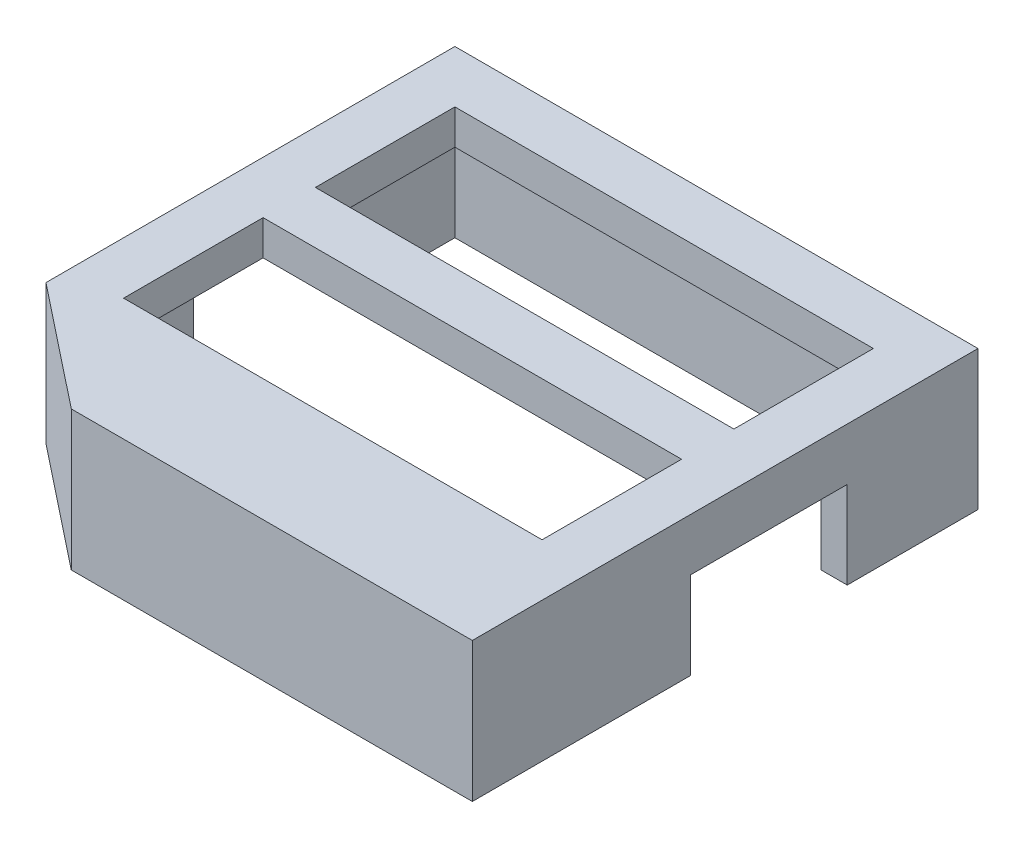
ISO-10303-21;
HEADER;
FILE_DESCRIPTION(('STEP AP214'),'2;1');
FILE_NAME('part.step','',(''),(''),'','','');
FILE_SCHEMA(('AUTOMOTIVE_DESIGN { 1 0 10303 214 1 1 1 1 }'));
ENDSEC;
DATA;
#1=APPLICATION_CONTEXT('core data for automotive mechanical design processes');
#2=APPLICATION_PROTOCOL_DEFINITION('international standard','automotive_design',2000,#1);
#3=PRODUCT_CONTEXT('',#1,'mechanical');
#4=PRODUCT('Part','Part','',(#3));
#5=PRODUCT_RELATED_PRODUCT_CATEGORY('part','',(#4));
#6=PRODUCT_DEFINITION_FORMATION('','',#4);
#7=PRODUCT_DEFINITION_CONTEXT('part definition',#1,'design');
#8=PRODUCT_DEFINITION('design','',#6,#7);
#9=PRODUCT_DEFINITION_SHAPE('','',#8);
#10=(LENGTH_UNIT() NAMED_UNIT(*) SI_UNIT(.MILLI.,.METRE.));
#11=(NAMED_UNIT(*) PLANE_ANGLE_UNIT() SI_UNIT($,.RADIAN.));
#12=(NAMED_UNIT(*) SI_UNIT($,.STERADIAN.) SOLID_ANGLE_UNIT());
#13=UNCERTAINTY_MEASURE_WITH_UNIT(LENGTH_MEASURE(1.E-05),#10,'distance_accuracy_value','');
#14=(GEOMETRIC_REPRESENTATION_CONTEXT(3) GLOBAL_UNCERTAINTY_ASSIGNED_CONTEXT((#13)) GLOBAL_UNIT_ASSIGNED_CONTEXT((#10,
#11,#12)) REPRESENTATION_CONTEXT('',''));
#15=CARTESIAN_POINT('',(0.,0.,0.));
#16=DIRECTION('',(0.,0.,1.));
#17=DIRECTION('',(1.,0.,0.));
#18=AXIS2_PLACEMENT_3D('',#15,#16,#17);
#19=CARTESIAN_POINT('',(0.,0.,0.));
#20=DIRECTION('',(0.,1.,0.));
#21=DIRECTION('',(0.,0.,1.));
#22=AXIS2_PLACEMENT_3D('',#19,#20,#21);
#23=PLANE('',#22);
#24=DIRECTION('',(0.,0.,-1.));
#25=VECTOR('',#24,1.);
#26=CARTESIAN_POINT('',(0.763392857142857,0.,-0.930803571428571));
#27=LINE('',#26,#25);
#28=CARTESIAN_POINT('',(0.763392857142872,0.,6.56919642857143));
#29=VERTEX_POINT('',#28);
#30=CARTESIAN_POINT('',(0.763392857142857,0.,-0.930803571428571));
#31=VERTEX_POINT('',#30);
#32=EDGE_CURVE('E232',#29,#31,#27,.T.);
#33=ORIENTED_EDGE('',*,*,#32,.F.);
#34=DIRECTION('',(-1.,0.,0.));
#35=VECTOR('',#34,1.);
#36=CARTESIAN_POINT('',(0.763392857142872,0.,6.56919642857143));
#37=LINE('',#36,#35);
#38=CARTESIAN_POINT('',(-0.736607142857139,0.,6.56919642857143));
#39=VERTEX_POINT('',#38);
#40=EDGE_CURVE('E213',#29,#39,#37,.T.);
#41=ORIENTED_EDGE('',*,*,#40,.T.);
#42=DIRECTION('',(0.,0.,1.));
#43=VECTOR('',#42,1.);
#44=CARTESIAN_POINT('',(-0.736607142857139,0.,0.569196428571429));
#45=LINE('',#44,#43);
#46=CARTESIAN_POINT('',(-0.736607142857139,0.,0.569196428571429));
#47=VERTEX_POINT('',#46);
#48=EDGE_CURVE('E336',#47,#39,#45,.T.);
#49=ORIENTED_EDGE('',*,*,#48,.F.);
#50=DIRECTION('',(1.,0.,0.));
#51=VECTOR('',#50,1.);
#52=CARTESIAN_POINT('',(-0.736607142857139,0.,0.569196428571429));
#53=LINE('',#52,#51);
#54=CARTESIAN_POINT('',(-27.7366071428571,0.,0.569196428571426));
#55=VERTEX_POINT('',#54);
#56=EDGE_CURVE('E319',#55,#47,#53,.T.);
#57=ORIENTED_EDGE('',*,*,#56,.F.);
#58=DIRECTION('',(0.,0.,-1.));
#59=VECTOR('',#58,1.);
#60=CARTESIAN_POINT('',(-27.7366071428571,0.,0.569196428571426));
#61=LINE('',#60,#59);
#62=CARTESIAN_POINT('',(-27.7366071428571,0.,6.56919642857143));
#63=VERTEX_POINT('',#62);
#64=EDGE_CURVE('E347',#63,#55,#61,.T.);
#65=ORIENTED_EDGE('',*,*,#64,.F.);
#66=CARTESIAN_POINT('',(-29.2366071428571,0.,6.56919642857143));
#67=VERTEX_POINT('',#66);
#68=EDGE_CURVE('E227',#63,#67,#37,.T.);
#69=ORIENTED_EDGE('',*,*,#68,.T.);
#70=DIRECTION('',(0.,0.,1.));
#71=VECTOR('',#70,1.);
#72=CARTESIAN_POINT('',(-29.2366071428571,0.,-0.930803571428571));
#73=LINE('',#72,#71);
#74=CARTESIAN_POINT('',(-29.2366071428571,0.,-0.930803571428571));
#75=VERTEX_POINT('',#74);
#76=EDGE_CURVE('E251',#75,#67,#73,.T.);
#77=ORIENTED_EDGE('',*,*,#76,.F.);
#78=DIRECTION('',(-1.,0.,0.));
#79=VECTOR('',#78,1.);
#80=CARTESIAN_POINT('',(-29.2366071428571,0.,-0.930803571428571));
#81=LINE('',#80,#79);
#82=EDGE_CURVE('E243',#31,#75,#81,.T.);
#83=ORIENTED_EDGE('',*,*,#82,.F.);
#84=EDGE_LOOP('',(#33,#41,#49,#57,#65,#69,#77,#83));
#85=FACE_BOUND('',#84,.T.);
#86=ADVANCED_FACE('F39',(#85),#23,.F.);
#87=CARTESIAN_POINT('',(-29.2366071428571,8.,-0.930803571428571));
#88=DIRECTION('',(1.,0.,0.));
#89=DIRECTION('',(0.,0.,-1.));
#90=AXIS2_PLACEMENT_3D('',#87,#88,#89);
#91=PLANE('',#90);
#92=ORIENTED_EDGE('',*,*,#76,.T.);
#93=DIRECTION('',(0.,-1.,0.));
#94=VECTOR('',#93,1.);
#95=CARTESIAN_POINT('',(-29.2366071428571,0.,6.56919642857143));
#96=LINE('',#95,#94);
#97=CARTESIAN_POINT('',(-29.2366071428571,5.,6.56919642857143));
#98=VERTEX_POINT('',#97);
#99=EDGE_CURVE('E516',#98,#67,#96,.T.);
#100=ORIENTED_EDGE('',*,*,#99,.F.);
#101=DIRECTION('',(0.,0.,-1.));
#102=VECTOR('',#101,1.);
#103=CARTESIAN_POINT('',(-29.2366071428571,5.,6.56919642857143));
#104=LINE('',#103,#102);
#105=CARTESIAN_POINT('',(-29.2366071428571,5.,15.5691964285714));
#106=VERTEX_POINT('',#105);
#107=EDGE_CURVE('E239',#106,#98,#104,.T.);
#108=ORIENTED_EDGE('',*,*,#107,.F.);
#109=DIRECTION('',(0.,1.,0.));
#110=VECTOR('',#109,1.);
#111=CARTESIAN_POINT('',(-29.2366071428571,0.,15.5691964285714));
#112=LINE('',#111,#110);
#113=CARTESIAN_POINT('',(-29.2366071428571,0.,15.5691964285714));
#114=VERTEX_POINT('',#113);
#115=EDGE_CURVE('E487',#114,#106,#112,.T.);
#116=ORIENTED_EDGE('',*,*,#115,.F.);
#117=CARTESIAN_POINT('',(-29.2366071428571,0.,22.5191407492151));
#118=VERTEX_POINT('',#117);
#119=EDGE_CURVE('E434',#114,#118,#73,.T.);
#120=ORIENTED_EDGE('',*,*,#119,.T.);
#121=DIRECTION('',(0.,1.,0.));
#122=VECTOR('',#121,1.);
#123=CARTESIAN_POINT('',(-29.2366071428571,0.,22.5191407492151));
#124=LINE('',#123,#122);
#125=CARTESIAN_POINT('',(-29.2366071428571,8.,22.5191407492151));
#126=VERTEX_POINT('',#125);
#127=EDGE_CURVE('E406',#118,#126,#124,.T.);
#128=ORIENTED_EDGE('',*,*,#127,.T.);
#129=DIRECTION('',(0.,0.,1.));
#130=VECTOR('',#129,1.);
#131=CARTESIAN_POINT('',(-29.2366071428571,8.,-0.930803571428571));
#132=LINE('',#131,#130);
#133=CARTESIAN_POINT('',(-29.2366071428571,8.,-0.930803571428571));
#134=VERTEX_POINT('',#133);
#135=EDGE_CURVE('E257',#134,#126,#132,.T.);
#136=ORIENTED_EDGE('',*,*,#135,.F.);
#137=DIRECTION('',(0.,-1.,0.));
#138=VECTOR('',#137,1.);
#139=CARTESIAN_POINT('',(-29.2366071428571,8.,-0.930803571428571));
#140=LINE('',#139,#138);
#141=EDGE_CURVE('E258',#134,#75,#140,.T.);
#142=ORIENTED_EDGE('',*,*,#141,.T.);
#143=EDGE_LOOP('',(#92,#100,#108,#116,#120,#128,#136,#142));
#144=FACE_BOUND('',#143,.T.);
#145=ADVANCED_FACE('F41',(#144),#91,.F.);
#146=CARTESIAN_POINT('',(-29.2366071428571,8.,28.0691964285714));
#147=DIRECTION('',(0.,0.,-1.));
#148=DIRECTION('',(-1.,0.,0.));
#149=AXIS2_PLACEMENT_3D('',#146,#147,#148);
#150=PLANE('',#149);
#151=DIRECTION('',(1.,0.,0.));
#152=VECTOR('',#151,1.);
#153=CARTESIAN_POINT('',(-29.2366071428571,8.,28.0691964285714));
#154=LINE('',#153,#152);
#155=CARTESIAN_POINT('',(-22.2366071428571,8.,28.0691964285714));
#156=VERTEX_POINT('',#155);
#157=CARTESIAN_POINT('',(0.763392857142861,8.,28.0691964285714));
#158=VERTEX_POINT('',#157);
#159=EDGE_CURVE('E472',#156,#158,#154,.T.);
#160=ORIENTED_EDGE('',*,*,#159,.F.);
#161=DIRECTION('',(0.,1.,0.));
#162=VECTOR('',#161,1.);
#163=CARTESIAN_POINT('',(-22.2366071428571,0.,28.0691964285714));
#164=LINE('',#163,#162);
#165=CARTESIAN_POINT('',(-22.2366071428571,0.,28.0691964285714));
#166=VERTEX_POINT('',#165);
#167=EDGE_CURVE('E403',#166,#156,#164,.T.);
#168=ORIENTED_EDGE('',*,*,#167,.F.);
#169=DIRECTION('',(1.,0.,0.));
#170=VECTOR('',#169,1.);
#171=CARTESIAN_POINT('',(-29.2366071428571,0.,28.0691964285714));
#172=LINE('',#171,#170);
#173=CARTESIAN_POINT('',(0.763392857142861,0.,28.0691964285714));
#174=VERTEX_POINT('',#173);
#175=EDGE_CURVE('E246',#166,#174,#172,.T.);
#176=ORIENTED_EDGE('',*,*,#175,.T.);
#177=DIRECTION('',(0.,-1.,0.));
#178=VECTOR('',#177,1.);
#179=CARTESIAN_POINT('',(0.763392857142861,8.,28.0691964285714));
#180=LINE('',#179,#178);
#181=EDGE_CURVE('E266',#158,#174,#180,.T.);
#182=ORIENTED_EDGE('',*,*,#181,.F.);
#183=EDGE_LOOP('',(#160,#168,#176,#182));
#184=FACE_BOUND('',#183,.T.);
#185=ADVANCED_FACE('F500',(#184),#150,.F.);
#186=CARTESIAN_POINT('',(0.763392857142857,8.,-0.930803571428571));
#187=DIRECTION('',(-1.,0.,0.));
#188=DIRECTION('',(0.,0.,1.));
#189=AXIS2_PLACEMENT_3D('',#186,#187,#188);
#190=PLANE('',#189);
#191=DIRECTION('',(0.,0.,-1.));
#192=VECTOR('',#191,1.);
#193=CARTESIAN_POINT('',(0.763392857142872,5.,6.56919642857143));
#194=LINE('',#193,#192);
#195=CARTESIAN_POINT('',(0.763392857142876,5.,15.5691964285714));
#196=VERTEX_POINT('',#195);
#197=CARTESIAN_POINT('',(0.763392857142872,5.,6.56919642857143));
#198=VERTEX_POINT('',#197);
#199=EDGE_CURVE('E236',#196,#198,#194,.T.);
#200=ORIENTED_EDGE('',*,*,#199,.T.);
#201=DIRECTION('',(0.,-1.,0.));
#202=VECTOR('',#201,1.);
#203=CARTESIAN_POINT('',(0.763392857142872,0.,6.56919642857143));
#204=LINE('',#203,#202);
#205=EDGE_CURVE('E217',#198,#29,#204,.T.);
#206=ORIENTED_EDGE('',*,*,#205,.T.);
#207=ORIENTED_EDGE('',*,*,#32,.T.);
#208=DIRECTION('',(0.,-1.,0.));
#209=VECTOR('',#208,1.);
#210=CARTESIAN_POINT('',(0.763392857142857,8.,-0.930803571428571));
#211=LINE('',#210,#209);
#212=CARTESIAN_POINT('',(0.763392857142857,8.,-0.930803571428571));
#213=VERTEX_POINT('',#212);
#214=EDGE_CURVE('E262',#213,#31,#211,.T.);
#215=ORIENTED_EDGE('',*,*,#214,.F.);
#216=DIRECTION('',(0.,0.,-1.));
#217=VECTOR('',#216,1.);
#218=CARTESIAN_POINT('',(0.763392857142857,8.,-0.930803571428571));
#219=LINE('',#218,#217);
#220=EDGE_CURVE('E475',#158,#213,#219,.T.);
#221=ORIENTED_EDGE('',*,*,#220,.F.);
#222=ORIENTED_EDGE('',*,*,#181,.T.);
#223=CARTESIAN_POINT('',(0.763392857142876,0.,15.5691964285714));
#224=VERTEX_POINT('',#223);
#225=EDGE_CURVE('E245',#174,#224,#27,.T.);
#226=ORIENTED_EDGE('',*,*,#225,.T.);
#227=DIRECTION('',(0.,1.,0.));
#228=VECTOR('',#227,1.);
#229=CARTESIAN_POINT('',(0.763392857142876,0.,15.5691964285714));
#230=LINE('',#229,#228);
#231=EDGE_CURVE('E238',#224,#196,#230,.T.);
#232=ORIENTED_EDGE('',*,*,#231,.T.);
#233=EDGE_LOOP('',(#200,#206,#207,#215,#221,#222,#226,#232));
#234=FACE_BOUND('',#233,.T.);
#235=ADVANCED_FACE('F230',(#234),#190,.F.);
#236=CARTESIAN_POINT('',(-29.2366071428571,8.,-0.930803571428571));
#237=DIRECTION('',(0.,0.,1.));
#238=DIRECTION('',(1.,0.,0.));
#239=AXIS2_PLACEMENT_3D('',#236,#237,#238);
#240=PLANE('',#239);
#241=ORIENTED_EDGE('',*,*,#82,.T.);
#242=ORIENTED_EDGE('',*,*,#141,.F.);
#243=DIRECTION('',(-1.,0.,0.));
#244=VECTOR('',#243,1.);
#245=CARTESIAN_POINT('',(-29.2366071428571,8.,-0.930803571428571));
#246=LINE('',#245,#244);
#247=EDGE_CURVE('E263',#213,#134,#246,.T.);
#248=ORIENTED_EDGE('',*,*,#247,.F.);
#249=ORIENTED_EDGE('',*,*,#214,.T.);
#250=EDGE_LOOP('',(#241,#242,#248,#249));
#251=FACE_BOUND('',#250,.T.);
#252=ADVANCED_FACE('F548',(#251),#240,.F.);
#253=CARTESIAN_POINT('',(0.,8.,0.));
#254=DIRECTION('',(0.,1.,0.));
#255=DIRECTION('',(0.,0.,1.));
#256=AXIS2_PLACEMENT_3D('',#253,#254,#255);
#257=PLANE('',#256);
#258=DIRECTION('',(-0.783588601449101,0.,-0.621280052535925));
#259=VECTOR('',#258,1.);
#260=CARTESIAN_POINT('',(-29.2366071428571,8.,22.5191407492151));
#261=LINE('',#260,#259);
#262=EDGE_CURVE('E398',#156,#126,#261,.T.);
#263=ORIENTED_EDGE('',*,*,#262,.F.);
#264=ORIENTED_EDGE('',*,*,#159,.T.);
#265=ORIENTED_EDGE('',*,*,#220,.T.);
#266=ORIENTED_EDGE('',*,*,#247,.T.);
#267=ORIENTED_EDGE('',*,*,#135,.T.);
#268=EDGE_LOOP('',(#263,#264,#265,#266,#267));
#269=FACE_BOUND('',#268,.T.);
#270=DIRECTION('',(0.,0.,1.));
#271=VECTOR('',#270,1.);
#272=CARTESIAN_POINT('',(-26.2366071428571,8.,2.06919642857143));
#273=LINE('',#272,#271);
#274=CARTESIAN_POINT('',(-26.2366071428571,8.,2.06919642857143));
#275=VERTEX_POINT('',#274);
#276=CARTESIAN_POINT('',(-26.2366071428571,8.,10.0691964285714));
#277=VERTEX_POINT('',#276);
#278=EDGE_CURVE('E413',#275,#277,#273,.T.);
#279=ORIENTED_EDGE('',*,*,#278,.F.);
#280=DIRECTION('',(-1.,0.,0.));
#281=VECTOR('',#280,1.);
#282=CARTESIAN_POINT('',(-26.2366071428571,8.,2.06919642857143));
#283=LINE('',#282,#281);
#284=CARTESIAN_POINT('',(-2.23660714285714,8.,2.06919642857143));
#285=VERTEX_POINT('',#284);
#286=EDGE_CURVE('E426',#285,#275,#283,.T.);
#287=ORIENTED_EDGE('',*,*,#286,.F.);
#288=DIRECTION('',(0.,0.,-1.));
#289=VECTOR('',#288,1.);
#290=CARTESIAN_POINT('',(-2.23660714285714,8.,2.06919642857143));
#291=LINE('',#290,#289);
#292=CARTESIAN_POINT('',(-2.23660714285714,8.,10.0691964285714));
#293=VERTEX_POINT('',#292);
#294=EDGE_CURVE('E422',#293,#285,#291,.T.);
#295=ORIENTED_EDGE('',*,*,#294,.F.);
#296=DIRECTION('',(1.,0.,0.));
#297=VECTOR('',#296,1.);
#298=CARTESIAN_POINT('',(-26.2366071428571,8.,10.0691964285714));
#299=LINE('',#298,#297);
#300=EDGE_CURVE('E417',#277,#293,#299,.T.);
#301=ORIENTED_EDGE('',*,*,#300,.F.);
#302=EDGE_LOOP('',(#279,#287,#295,#301));
#303=FACE_BOUND('',#302,.T.);
#304=DIRECTION('',(0.,0.,1.));
#305=VECTOR('',#304,1.);
#306=CARTESIAN_POINT('',(-26.2366071428571,8.,13.0691964285714));
#307=LINE('',#306,#305);
#308=CARTESIAN_POINT('',(-26.2366071428571,8.,13.0691964285714));
#309=VERTEX_POINT('',#308);
#310=CARTESIAN_POINT('',(-26.2366071428571,8.,21.0691964285714));
#311=VERTEX_POINT('',#310);
#312=EDGE_CURVE('E410',#309,#311,#307,.T.);
#313=ORIENTED_EDGE('',*,*,#312,.F.);
#314=DIRECTION('',(-1.,0.,0.));
#315=VECTOR('',#314,1.);
#316=CARTESIAN_POINT('',(-26.2366071428571,8.,13.0691964285714));
#317=LINE('',#316,#315);
#318=CARTESIAN_POINT('',(-2.23660714285714,8.,13.0691964285714));
#319=VERTEX_POINT('',#318);
#320=EDGE_CURVE('E454',#319,#309,#317,.T.);
#321=ORIENTED_EDGE('',*,*,#320,.F.);
#322=DIRECTION('',(0.,0.,-1.));
#323=VECTOR('',#322,1.);
#324=CARTESIAN_POINT('',(-2.23660714285714,8.,13.0691964285714));
#325=LINE('',#324,#323);
#326=CARTESIAN_POINT('',(-2.23660714285714,8.,21.0691964285714));
#327=VERTEX_POINT('',#326);
#328=EDGE_CURVE('E450',#327,#319,#325,.T.);
#329=ORIENTED_EDGE('',*,*,#328,.F.);
#330=DIRECTION('',(1.,0.,0.));
#331=VECTOR('',#330,1.);
#332=CARTESIAN_POINT('',(-26.2366071428571,8.,21.0691964285714));
#333=LINE('',#332,#331);
#334=EDGE_CURVE('E446',#311,#327,#333,.T.);
#335=ORIENTED_EDGE('',*,*,#334,.F.);
#336=EDGE_LOOP('',(#313,#321,#329,#335));
#337=FACE_BOUND('',#336,.T.);
#338=ADVANCED_FACE('F504',(#269,#303,#337),#257,.T.);
#339=ORIENTED_EDGE('',*,*,#119,.F.);
#340=DIRECTION('',(-1.,0.,0.));
#341=VECTOR('',#340,1.);
#342=CARTESIAN_POINT('',(0.763392857142876,0.,15.5691964285714));
#343=LINE('',#342,#341);
#344=CARTESIAN_POINT('',(-27.7366071428571,0.,15.5691964285714));
#345=VERTEX_POINT('',#344);
#346=EDGE_CURVE('E226',#345,#114,#343,.T.);
#347=ORIENTED_EDGE('',*,*,#346,.F.);
#348=CARTESIAN_POINT('',(-27.7366071428571,0.,21.7941685888933));
#349=VERTEX_POINT('',#348);
#350=EDGE_CURVE('E348',#349,#345,#61,.T.);
#351=ORIENTED_EDGE('',*,*,#350,.F.);
#352=DIRECTION('',(-0.783588601449101,0.,-0.621280052535925));
#353=VECTOR('',#352,1.);
#354=CARTESIAN_POINT('',(-27.7366071428571,0.,21.7941685888933));
#355=LINE('',#354,#353);
#356=CARTESIAN_POINT('',(-21.714109926825,0.,26.5691964285714));
#357=VERTEX_POINT('',#356);
#358=EDGE_CURVE('E343',#357,#349,#355,.T.);
#359=ORIENTED_EDGE('',*,*,#358,.F.);
#360=DIRECTION('',(-1.,0.,0.));
#361=VECTOR('',#360,1.);
#362=CARTESIAN_POINT('',(-21.714109926825,0.,26.5691964285714));
#363=LINE('',#362,#361);
#364=CARTESIAN_POINT('',(-0.73660714285714,0.,26.5691964285714));
#365=VERTEX_POINT('',#364);
#366=EDGE_CURVE('E339',#365,#357,#363,.T.);
#367=ORIENTED_EDGE('',*,*,#366,.F.);
#368=CARTESIAN_POINT('',(-0.736607142857139,0.,15.5691964285714));
#369=VERTEX_POINT('',#368);
#370=EDGE_CURVE('E313',#369,#365,#45,.T.);
#371=ORIENTED_EDGE('',*,*,#370,.F.);
#372=EDGE_CURVE('E55',#224,#369,#343,.T.);
#373=ORIENTED_EDGE('',*,*,#372,.F.);
#374=ORIENTED_EDGE('',*,*,#225,.F.);
#375=ORIENTED_EDGE('',*,*,#175,.F.);
#376=DIRECTION('',(-0.783588601449101,0.,-0.621280052535925));
#377=VECTOR('',#376,1.);
#378=CARTESIAN_POINT('',(-29.2366071428571,0.,22.5191407492151));
#379=LINE('',#378,#377);
#380=EDGE_CURVE('E399',#166,#118,#379,.T.);
#381=ORIENTED_EDGE('',*,*,#380,.T.);
#382=EDGE_LOOP('',(#339,#347,#351,#359,#367,#371,#373,#374,#375,#381));
#383=FACE_BOUND('',#382,.T.);
#384=ADVANCED_FACE('F495',(#383),#23,.F.);
#385=CARTESIAN_POINT('',(-26.2366071428571,0.,13.0691964285714));
#386=DIRECTION('',(-1.,0.,0.));
#387=DIRECTION('',(0.,0.,1.));
#388=AXIS2_PLACEMENT_3D('',#385,#386,#387);
#389=PLANE('',#388);
#390=DIRECTION('',(0.,1.,0.));
#391=VECTOR('',#390,1.);
#392=CARTESIAN_POINT('',(-26.2366071428571,0.,21.0691964285714));
#393=LINE('',#392,#391);
#394=CARTESIAN_POINT('',(-26.2366071428571,6.,21.0691964285714));
#395=VERTEX_POINT('',#394);
#396=EDGE_CURVE('E458',#395,#311,#393,.T.);
#397=ORIENTED_EDGE('',*,*,#396,.F.);
#398=DIRECTION('',(0.,0.,-1.));
#399=VECTOR('',#398,1.);
#400=CARTESIAN_POINT('',(-26.2366071428571,6.,13.0691964285714));
#401=LINE('',#400,#399);
#402=CARTESIAN_POINT('',(-26.2366071428571,6.,13.0691964285714));
#403=VERTEX_POINT('',#402);
#404=EDGE_CURVE('E394',#395,#403,#401,.T.);
#405=ORIENTED_EDGE('',*,*,#404,.T.);
#406=DIRECTION('',(0.,1.,0.));
#407=VECTOR('',#406,1.);
#408=CARTESIAN_POINT('',(-26.2366071428571,0.,13.0691964285714));
#409=LINE('',#408,#407);
#410=EDGE_CURVE('E418',#403,#309,#409,.T.);
#411=ORIENTED_EDGE('',*,*,#410,.T.);
#412=ORIENTED_EDGE('',*,*,#312,.T.);
#413=EDGE_LOOP('',(#397,#405,#411,#412));
#414=FACE_BOUND('',#413,.T.);
#415=ADVANCED_FACE('F540',(#414),#389,.F.);
#416=CARTESIAN_POINT('',(-26.2366071428571,0.,13.0691964285714));
#417=DIRECTION('',(0.,0.,-1.));
#418=DIRECTION('',(-1.,0.,0.));
#419=AXIS2_PLACEMENT_3D('',#416,#417,#418);
#420=PLANE('',#419);
#421=ORIENTED_EDGE('',*,*,#410,.F.);
#422=DIRECTION('',(1.,0.,0.));
#423=VECTOR('',#422,1.);
#424=CARTESIAN_POINT('',(-26.2366071428571,6.,13.0691964285714));
#425=LINE('',#424,#423);
#426=CARTESIAN_POINT('',(-2.23660714285714,6.,13.0691964285714));
#427=VERTEX_POINT('',#426);
#428=EDGE_CURVE('E390',#403,#427,#425,.T.);
#429=ORIENTED_EDGE('',*,*,#428,.T.);
#430=DIRECTION('',(0.,1.,0.));
#431=VECTOR('',#430,1.);
#432=CARTESIAN_POINT('',(-2.23660714285714,0.,13.0691964285714));
#433=LINE('',#432,#431);
#434=EDGE_CURVE('E461',#427,#319,#433,.T.);
#435=ORIENTED_EDGE('',*,*,#434,.T.);
#436=ORIENTED_EDGE('',*,*,#320,.T.);
#437=EDGE_LOOP('',(#421,#429,#435,#436));
#438=FACE_BOUND('',#437,.T.);
#439=ADVANCED_FACE('F545',(#438),#420,.F.);
#440=CARTESIAN_POINT('',(-2.23660714285714,0.,13.0691964285714));
#441=DIRECTION('',(1.,0.,0.));
#442=DIRECTION('',(0.,0.,-1.));
#443=AXIS2_PLACEMENT_3D('',#440,#441,#442);
#444=PLANE('',#443);
#445=ORIENTED_EDGE('',*,*,#434,.F.);
#446=DIRECTION('',(0.,0.,1.));
#447=VECTOR('',#446,1.);
#448=CARTESIAN_POINT('',(-2.23660714285714,6.,13.0691964285714));
#449=LINE('',#448,#447);
#450=CARTESIAN_POINT('',(-2.23660714285714,6.,21.0691964285714));
#451=VERTEX_POINT('',#450);
#452=EDGE_CURVE('E386',#427,#451,#449,.T.);
#453=ORIENTED_EDGE('',*,*,#452,.T.);
#454=DIRECTION('',(0.,1.,0.));
#455=VECTOR('',#454,1.);
#456=CARTESIAN_POINT('',(-2.23660714285714,0.,21.0691964285714));
#457=LINE('',#456,#455);
#458=EDGE_CURVE('E464',#451,#327,#457,.T.);
#459=ORIENTED_EDGE('',*,*,#458,.T.);
#460=ORIENTED_EDGE('',*,*,#328,.T.);
#461=EDGE_LOOP('',(#445,#453,#459,#460));
#462=FACE_BOUND('',#461,.T.);
#463=ADVANCED_FACE('F557',(#462),#444,.F.);
#464=CARTESIAN_POINT('',(-26.2366071428571,0.,21.0691964285714));
#465=DIRECTION('',(0.,0.,1.));
#466=DIRECTION('',(1.,0.,0.));
#467=AXIS2_PLACEMENT_3D('',#464,#465,#466);
#468=PLANE('',#467);
#469=ORIENTED_EDGE('',*,*,#458,.F.);
#470=DIRECTION('',(-1.,0.,0.));
#471=VECTOR('',#470,1.);
#472=CARTESIAN_POINT('',(-26.2366071428571,6.,21.0691964285714));
#473=LINE('',#472,#471);
#474=EDGE_CURVE('E382',#451,#395,#473,.T.);
#475=ORIENTED_EDGE('',*,*,#474,.T.);
#476=ORIENTED_EDGE('',*,*,#396,.T.);
#477=ORIENTED_EDGE('',*,*,#334,.T.);
#478=EDGE_LOOP('',(#469,#475,#476,#477));
#479=FACE_BOUND('',#478,.T.);
#480=ADVANCED_FACE('F553',(#479),#468,.F.);
#481=CARTESIAN_POINT('',(-26.2366071428571,0.,2.06919642857143));
#482=DIRECTION('',(-1.,0.,0.));
#483=DIRECTION('',(0.,0.,1.));
#484=AXIS2_PLACEMENT_3D('',#481,#482,#483);
#485=PLANE('',#484);
#486=DIRECTION('',(0.,1.,0.));
#487=VECTOR('',#486,1.);
#488=CARTESIAN_POINT('',(-26.2366071428571,0.,10.0691964285714));
#489=LINE('',#488,#487);
#490=CARTESIAN_POINT('',(-26.2366071428571,6.,10.0691964285714));
#491=VERTEX_POINT('',#490);
#492=EDGE_CURVE('E430',#491,#277,#489,.T.);
#493=ORIENTED_EDGE('',*,*,#492,.F.);
#494=DIRECTION('',(0.,0.,-1.));
#495=VECTOR('',#494,1.);
#496=CARTESIAN_POINT('',(-26.2366071428571,6.,2.06919642857143));
#497=LINE('',#496,#495);
#498=CARTESIAN_POINT('',(-26.2366071428571,6.,2.06919642857143));
#499=VERTEX_POINT('',#498);
#500=EDGE_CURVE('E378',#491,#499,#497,.T.);
#501=ORIENTED_EDGE('',*,*,#500,.T.);
#502=DIRECTION('',(0.,1.,0.));
#503=VECTOR('',#502,1.);
#504=CARTESIAN_POINT('',(-26.2366071428571,0.,2.06919642857143));
#505=LINE('',#504,#503);
#506=EDGE_CURVE('E431',#499,#275,#505,.T.);
#507=ORIENTED_EDGE('',*,*,#506,.T.);
#508=ORIENTED_EDGE('',*,*,#278,.T.);
#509=EDGE_LOOP('',(#493,#501,#507,#508));
#510=FACE_BOUND('',#509,.T.);
#511=ADVANCED_FACE('F556',(#510),#485,.F.);
#512=CARTESIAN_POINT('',(-26.2366071428571,0.,2.06919642857143));
#513=DIRECTION('',(0.,0.,-1.));
#514=DIRECTION('',(-1.,0.,0.));
#515=AXIS2_PLACEMENT_3D('',#512,#513,#514);
#516=PLANE('',#515);
#517=ORIENTED_EDGE('',*,*,#506,.F.);
#518=DIRECTION('',(1.,0.,0.));
#519=VECTOR('',#518,1.);
#520=CARTESIAN_POINT('',(-26.2366071428571,6.,2.06919642857143));
#521=LINE('',#520,#519);
#522=CARTESIAN_POINT('',(-2.23660714285714,6.,2.06919642857143));
#523=VERTEX_POINT('',#522);
#524=EDGE_CURVE('E374',#499,#523,#521,.T.);
#525=ORIENTED_EDGE('',*,*,#524,.T.);
#526=DIRECTION('',(0.,1.,0.));
#527=VECTOR('',#526,1.);
#528=CARTESIAN_POINT('',(-2.23660714285714,0.,2.06919642857143));
#529=LINE('',#528,#527);
#530=EDGE_CURVE('E435',#523,#285,#529,.T.);
#531=ORIENTED_EDGE('',*,*,#530,.T.);
#532=ORIENTED_EDGE('',*,*,#286,.T.);
#533=EDGE_LOOP('',(#517,#525,#531,#532));
#534=FACE_BOUND('',#533,.T.);
#535=ADVANCED_FACE('F567',(#534),#516,.F.);
#536=CARTESIAN_POINT('',(-2.23660714285714,0.,2.06919642857143));
#537=DIRECTION('',(1.,0.,0.));
#538=DIRECTION('',(0.,0.,-1.));
#539=AXIS2_PLACEMENT_3D('',#536,#537,#538);
#540=PLANE('',#539);
#541=ORIENTED_EDGE('',*,*,#530,.F.);
#542=DIRECTION('',(0.,0.,1.));
#543=VECTOR('',#542,1.);
#544=CARTESIAN_POINT('',(-2.23660714285714,6.,2.06919642857143));
#545=LINE('',#544,#543);
#546=CARTESIAN_POINT('',(-2.23660714285714,6.,10.0691964285714));
#547=VERTEX_POINT('',#546);
#548=EDGE_CURVE('E357',#523,#547,#545,.T.);
#549=ORIENTED_EDGE('',*,*,#548,.T.);
#550=DIRECTION('',(0.,1.,0.));
#551=VECTOR('',#550,1.);
#552=CARTESIAN_POINT('',(-2.23660714285714,0.,10.0691964285714));
#553=LINE('',#552,#551);
#554=EDGE_CURVE('E438',#547,#293,#553,.T.);
#555=ORIENTED_EDGE('',*,*,#554,.T.);
#556=ORIENTED_EDGE('',*,*,#294,.T.);
#557=EDGE_LOOP('',(#541,#549,#555,#556));
#558=FACE_BOUND('',#557,.T.);
#559=ADVANCED_FACE('F572',(#558),#540,.F.);
#560=CARTESIAN_POINT('',(-26.2366071428571,0.,10.0691964285714));
#561=DIRECTION('',(0.,0.,1.));
#562=DIRECTION('',(1.,0.,0.));
#563=AXIS2_PLACEMENT_3D('',#560,#561,#562);
#564=PLANE('',#563);
#565=ORIENTED_EDGE('',*,*,#554,.F.);
#566=DIRECTION('',(-1.,0.,0.));
#567=VECTOR('',#566,1.);
#568=CARTESIAN_POINT('',(-26.2366071428571,6.,10.0691964285714));
#569=LINE('',#568,#567);
#570=EDGE_CURVE('E270',#547,#491,#569,.T.);
#571=ORIENTED_EDGE('',*,*,#570,.T.);
#572=ORIENTED_EDGE('',*,*,#492,.T.);
#573=ORIENTED_EDGE('',*,*,#300,.T.);
#574=EDGE_LOOP('',(#565,#571,#572,#573));
#575=FACE_BOUND('',#574,.T.);
#576=ADVANCED_FACE('F569',(#575),#564,.F.);
#577=CARTESIAN_POINT('',(-29.2366071428571,0.,22.5191407492151));
#578=DIRECTION('',(0.621280052535925,0.,-0.783588601449101));
#579=DIRECTION('',(-0.783588601449101,0.,-0.621280052535925));
#580=AXIS2_PLACEMENT_3D('',#577,#578,#579);
#581=PLANE('',#580);
#582=ORIENTED_EDGE('',*,*,#262,.T.);
#583=ORIENTED_EDGE('',*,*,#127,.F.);
#584=ORIENTED_EDGE('',*,*,#380,.F.);
#585=ORIENTED_EDGE('',*,*,#167,.T.);
#586=EDGE_LOOP('',(#582,#583,#584,#585));
#587=FACE_BOUND('',#586,.T.);
#588=ADVANCED_FACE('F491',(#587),#581,.F.);
#589=CARTESIAN_POINT('',(0.,6.,0.));
#590=DIRECTION('',(0.,1.,0.));
#591=DIRECTION('',(0.,0.,1.));
#592=AXIS2_PLACEMENT_3D('',#589,#590,#591);
#593=PLANE('',#592);
#594=DIRECTION('',(0.,0.,1.));
#595=VECTOR('',#594,1.);
#596=CARTESIAN_POINT('',(-0.736607142857139,6.,0.569196428571429));
#597=LINE('',#596,#595);
#598=CARTESIAN_POINT('',(-0.736607142857139,6.,0.569196428571429));
#599=VERTEX_POINT('',#598);
#600=CARTESIAN_POINT('',(-0.73660714285714,6.,26.5691964285714));
#601=VERTEX_POINT('',#600);
#602=EDGE_CURVE('E314',#599,#601,#597,.T.);
#603=ORIENTED_EDGE('',*,*,#602,.T.);
#604=DIRECTION('',(-1.,0.,0.));
#605=VECTOR('',#604,1.);
#606=CARTESIAN_POINT('',(-21.714109926825,6.,26.5691964285714));
#607=LINE('',#606,#605);
#608=CARTESIAN_POINT('',(-21.714109926825,6.,26.5691964285714));
#609=VERTEX_POINT('',#608);
#610=EDGE_CURVE('E318',#601,#609,#607,.T.);
#611=ORIENTED_EDGE('',*,*,#610,.T.);
#612=DIRECTION('',(-0.783588601449101,0.,-0.621280052535925));
#613=VECTOR('',#612,1.);
#614=CARTESIAN_POINT('',(-27.7366071428571,6.,21.7941685888933));
#615=LINE('',#614,#613);
#616=CARTESIAN_POINT('',(-27.7366071428571,6.,21.7941685888933));
#617=VERTEX_POINT('',#616);
#618=EDGE_CURVE('E323',#609,#617,#615,.T.);
#619=ORIENTED_EDGE('',*,*,#618,.T.);
#620=DIRECTION('',(0.,0.,-1.));
#621=VECTOR('',#620,1.);
#622=CARTESIAN_POINT('',(-27.7366071428571,6.,0.569196428571426));
#623=LINE('',#622,#621);
#624=CARTESIAN_POINT('',(-27.7366071428571,6.,0.569196428571426));
#625=VERTEX_POINT('',#624);
#626=EDGE_CURVE('E327',#617,#625,#623,.T.);
#627=ORIENTED_EDGE('',*,*,#626,.T.);
#628=DIRECTION('',(1.,0.,0.));
#629=VECTOR('',#628,1.);
#630=CARTESIAN_POINT('',(-0.736607142857139,6.,0.569196428571429));
#631=LINE('',#630,#629);
#632=EDGE_CURVE('E331',#625,#599,#631,.T.);
#633=ORIENTED_EDGE('',*,*,#632,.T.);
#634=EDGE_LOOP('',(#603,#611,#619,#627,#633));
#635=FACE_BOUND('',#634,.T.);
#636=ORIENTED_EDGE('',*,*,#570,.F.);
#637=ORIENTED_EDGE('',*,*,#548,.F.);
#638=ORIENTED_EDGE('',*,*,#524,.F.);
#639=ORIENTED_EDGE('',*,*,#500,.F.);
#640=EDGE_LOOP('',(#636,#637,#638,#639));
#641=FACE_BOUND('',#640,.T.);
#642=ORIENTED_EDGE('',*,*,#474,.F.);
#643=ORIENTED_EDGE('',*,*,#452,.F.);
#644=ORIENTED_EDGE('',*,*,#428,.F.);
#645=ORIENTED_EDGE('',*,*,#404,.F.);
#646=EDGE_LOOP('',(#642,#643,#644,#645));
#647=FACE_BOUND('',#646,.T.);
#648=ADVANCED_FACE('F582',(#635,#641,#647),#593,.F.);
#649=CARTESIAN_POINT('',(-0.736607142857139,6.,0.569196428571429));
#650=DIRECTION('',(1.,0.,0.));
#651=DIRECTION('',(0.,0.,-1.));
#652=AXIS2_PLACEMENT_3D('',#649,#650,#651);
#653=PLANE('',#652);
#654=ORIENTED_EDGE('',*,*,#48,.T.);
#655=DIRECTION('',(0.,1.,0.));
#656=VECTOR('',#655,1.);
#657=CARTESIAN_POINT('',(-0.736607142857139,6.,6.56919642857143));
#658=LINE('',#657,#656);
#659=CARTESIAN_POINT('',(-0.736607142857139,5.,6.56919642857143));
#660=VERTEX_POINT('',#659);
#661=EDGE_CURVE('E220',#39,#660,#658,.T.);
#662=ORIENTED_EDGE('',*,*,#661,.T.);
#663=DIRECTION('',(0.,0.,1.));
#664=VECTOR('',#663,1.);
#665=CARTESIAN_POINT('',(-0.736607142857139,5.,0.569196428571429));
#666=LINE('',#665,#664);
#667=CARTESIAN_POINT('',(-0.73660714285714,5.,15.5691964285714));
#668=VERTEX_POINT('',#667);
#669=EDGE_CURVE('E307',#660,#668,#666,.T.);
#670=ORIENTED_EDGE('',*,*,#669,.T.);
#671=DIRECTION('',(0.,-1.,0.));
#672=VECTOR('',#671,1.);
#673=CARTESIAN_POINT('',(-0.736607142857139,6.,15.5691964285714));
#674=LINE('',#673,#672);
#675=EDGE_CURVE('E297',#668,#369,#674,.T.);
#676=ORIENTED_EDGE('',*,*,#675,.T.);
#677=ORIENTED_EDGE('',*,*,#370,.T.);
#678=DIRECTION('',(0.,-1.,0.));
#679=VECTOR('',#678,1.);
#680=CARTESIAN_POINT('',(-0.73660714285714,6.,26.5691964285714));
#681=LINE('',#680,#679);
#682=EDGE_CURVE('E335',#601,#365,#681,.T.);
#683=ORIENTED_EDGE('',*,*,#682,.F.);
#684=ORIENTED_EDGE('',*,*,#602,.F.);
#685=DIRECTION('',(0.,-1.,0.));
#686=VECTOR('',#685,1.);
#687=CARTESIAN_POINT('',(-0.736607142857139,6.,0.569196428571429));
#688=LINE('',#687,#686);
#689=EDGE_CURVE('E354',#599,#47,#688,.T.);
#690=ORIENTED_EDGE('',*,*,#689,.T.);
#691=EDGE_LOOP('',(#654,#662,#670,#676,#677,#683,#684,#690));
#692=FACE_BOUND('',#691,.T.);
#693=ADVANCED_FACE('F583',(#692),#653,.F.);
#694=CARTESIAN_POINT('',(-0.736607142857139,6.,0.569196428571429));
#695=DIRECTION('',(0.,0.,-1.));
#696=DIRECTION('',(-1.,0.,0.));
#697=AXIS2_PLACEMENT_3D('',#694,#695,#696);
#698=PLANE('',#697);
#699=ORIENTED_EDGE('',*,*,#56,.T.);
#700=ORIENTED_EDGE('',*,*,#689,.F.);
#701=ORIENTED_EDGE('',*,*,#632,.F.);
#702=DIRECTION('',(0.,-1.,0.));
#703=VECTOR('',#702,1.);
#704=CARTESIAN_POINT('',(-27.7366071428571,6.,0.569196428571426));
#705=LINE('',#704,#703);
#706=EDGE_CURVE('E358',#625,#55,#705,.T.);
#707=ORIENTED_EDGE('',*,*,#706,.T.);
#708=EDGE_LOOP('',(#699,#700,#701,#707));
#709=FACE_BOUND('',#708,.T.);
#710=ADVANCED_FACE('F586',(#709),#698,.F.);
#711=CARTESIAN_POINT('',(-27.7366071428571,6.,0.569196428571426));
#712=DIRECTION('',(-1.,0.,0.));
#713=DIRECTION('',(0.,0.,1.));
#714=AXIS2_PLACEMENT_3D('',#711,#712,#713);
#715=PLANE('',#714);
#716=DIRECTION('',(0.,0.,-1.));
#717=VECTOR('',#716,1.);
#718=CARTESIAN_POINT('',(-27.7366071428571,5.,0.569196428571426));
#719=LINE('',#718,#717);
#720=CARTESIAN_POINT('',(-27.7366071428571,5.,15.5691964285714));
#721=VERTEX_POINT('',#720);
#722=CARTESIAN_POINT('',(-27.7366071428571,5.,6.56919642857143));
#723=VERTEX_POINT('',#722);
#724=EDGE_CURVE('E48',#721,#723,#719,.T.);
#725=ORIENTED_EDGE('',*,*,#724,.T.);
#726=DIRECTION('',(0.,-1.,0.));
#727=VECTOR('',#726,1.);
#728=CARTESIAN_POINT('',(-27.7366071428571,6.,6.56919642857143));
#729=LINE('',#728,#727);
#730=EDGE_CURVE('E11',#723,#63,#729,.T.);
#731=ORIENTED_EDGE('',*,*,#730,.T.);
#732=ORIENTED_EDGE('',*,*,#64,.T.);
#733=ORIENTED_EDGE('',*,*,#706,.F.);
#734=ORIENTED_EDGE('',*,*,#626,.F.);
#735=DIRECTION('',(0.,-1.,0.));
#736=VECTOR('',#735,1.);
#737=CARTESIAN_POINT('',(-27.7366071428571,6.,21.7941685888933));
#738=LINE('',#737,#736);
#739=EDGE_CURVE('E362',#617,#349,#738,.T.);
#740=ORIENTED_EDGE('',*,*,#739,.T.);
#741=ORIENTED_EDGE('',*,*,#350,.T.);
#742=DIRECTION('',(0.,1.,0.));
#743=VECTOR('',#742,1.);
#744=CARTESIAN_POINT('',(-27.7366071428571,6.,15.5691964285714));
#745=LINE('',#744,#743);
#746=EDGE_CURVE('E274',#345,#721,#745,.T.);
#747=ORIENTED_EDGE('',*,*,#746,.T.);
#748=EDGE_LOOP('',(#725,#731,#732,#733,#734,#740,#741,#747));
#749=FACE_BOUND('',#748,.T.);
#750=ADVANCED_FACE('F280',(#749),#715,.F.);
#751=CARTESIAN_POINT('',(-27.7366071428571,6.,21.7941685888933));
#752=DIRECTION('',(-0.621280052535925,0.,0.783588601449101));
#753=DIRECTION('',(0.783588601449101,0.,0.621280052535925));
#754=AXIS2_PLACEMENT_3D('',#751,#752,#753);
#755=PLANE('',#754);
#756=ORIENTED_EDGE('',*,*,#358,.T.);
#757=ORIENTED_EDGE('',*,*,#739,.F.);
#758=ORIENTED_EDGE('',*,*,#618,.F.);
#759=DIRECTION('',(0.,-1.,0.));
#760=VECTOR('',#759,1.);
#761=CARTESIAN_POINT('',(-21.714109926825,6.,26.5691964285714));
#762=LINE('',#761,#760);
#763=EDGE_CURVE('E365',#609,#357,#762,.T.);
#764=ORIENTED_EDGE('',*,*,#763,.T.);
#765=EDGE_LOOP('',(#756,#757,#758,#764));
#766=FACE_BOUND('',#765,.T.);
#767=ADVANCED_FACE('F591',(#766),#755,.F.);
#768=CARTESIAN_POINT('',(-21.714109926825,6.,26.5691964285714));
#769=DIRECTION('',(0.,0.,1.));
#770=DIRECTION('',(1.,0.,0.));
#771=AXIS2_PLACEMENT_3D('',#768,#769,#770);
#772=PLANE('',#771);
#773=ORIENTED_EDGE('',*,*,#366,.T.);
#774=ORIENTED_EDGE('',*,*,#763,.F.);
#775=ORIENTED_EDGE('',*,*,#610,.F.);
#776=ORIENTED_EDGE('',*,*,#682,.T.);
#777=EDGE_LOOP('',(#773,#774,#775,#776));
#778=FACE_BOUND('',#777,.T.);
#779=ADVANCED_FACE('F588',(#778),#772,.F.);
#780=CARTESIAN_POINT('',(0.763392857142876,0.,15.5691964285714));
#781=DIRECTION('',(0.,0.,1.));
#782=DIRECTION('',(1.,0.,0.));
#783=AXIS2_PLACEMENT_3D('',#780,#781,#782);
#784=PLANE('',#783);
#785=ORIENTED_EDGE('',*,*,#346,.T.);
#786=ORIENTED_EDGE('',*,*,#115,.T.);
#787=DIRECTION('',(-1.,0.,0.));
#788=VECTOR('',#787,1.);
#789=CARTESIAN_POINT('',(0.763392857142876,5.,15.5691964285714));
#790=LINE('',#789,#788);
#791=EDGE_CURVE('E63',#721,#106,#790,.T.);
#792=ORIENTED_EDGE('',*,*,#791,.F.);
#793=ORIENTED_EDGE('',*,*,#746,.F.);
#794=EDGE_LOOP('',(#785,#786,#792,#793));
#795=FACE_BOUND('',#794,.T.);
#796=ADVANCED_FACE('F520',(#795),#784,.F.);
#797=CARTESIAN_POINT('',(0.763392857142872,5.,6.56919642857143));
#798=DIRECTION('',(0.,1.,0.));
#799=DIRECTION('',(0.,0.,1.));
#800=AXIS2_PLACEMENT_3D('',#797,#798,#799);
#801=PLANE('',#800);
#802=ORIENTED_EDGE('',*,*,#791,.T.);
#803=ORIENTED_EDGE('',*,*,#107,.T.);
#804=DIRECTION('',(-1.,0.,0.));
#805=VECTOR('',#804,1.);
#806=CARTESIAN_POINT('',(0.763392857142872,5.,6.56919642857143));
#807=LINE('',#806,#805);
#808=EDGE_CURVE('E287',#723,#98,#807,.T.);
#809=ORIENTED_EDGE('',*,*,#808,.F.);
#810=ORIENTED_EDGE('',*,*,#724,.F.);
#811=EDGE_LOOP('',(#802,#803,#809,#810));
#812=FACE_BOUND('',#811,.T.);
#813=ADVANCED_FACE('F285',(#812),#801,.F.);
#814=CARTESIAN_POINT('',(0.763392857142872,0.,6.56919642857143));
#815=DIRECTION('',(0.,0.,-1.));
#816=DIRECTION('',(-1.,0.,0.));
#817=AXIS2_PLACEMENT_3D('',#814,#815,#816);
#818=PLANE('',#817);
#819=ORIENTED_EDGE('',*,*,#808,.T.);
#820=ORIENTED_EDGE('',*,*,#99,.T.);
#821=ORIENTED_EDGE('',*,*,#68,.F.);
#822=ORIENTED_EDGE('',*,*,#730,.F.);
#823=EDGE_LOOP('',(#819,#820,#821,#822));
#824=FACE_BOUND('',#823,.T.);
#825=ADVANCED_FACE('F521',(#824),#818,.F.);
#826=ORIENTED_EDGE('',*,*,#40,.F.);
#827=ORIENTED_EDGE('',*,*,#205,.F.);
#828=EDGE_CURVE('E292',#198,#660,#807,.T.);
#829=ORIENTED_EDGE('',*,*,#828,.T.);
#830=ORIENTED_EDGE('',*,*,#661,.F.);
#831=EDGE_LOOP('',(#826,#827,#829,#830));
#832=FACE_BOUND('',#831,.T.);
#833=ADVANCED_FACE('F215',(#832),#818,.F.);
#834=ORIENTED_EDGE('',*,*,#828,.F.);
#835=ORIENTED_EDGE('',*,*,#199,.F.);
#836=EDGE_CURVE('E293',#196,#668,#790,.T.);
#837=ORIENTED_EDGE('',*,*,#836,.T.);
#838=ORIENTED_EDGE('',*,*,#669,.F.);
#839=EDGE_LOOP('',(#834,#835,#837,#838));
#840=FACE_BOUND('',#839,.T.);
#841=ADVANCED_FACE('F528',(#840),#801,.F.);
#842=ORIENTED_EDGE('',*,*,#836,.F.);
#843=ORIENTED_EDGE('',*,*,#231,.F.);
#844=ORIENTED_EDGE('',*,*,#372,.T.);
#845=ORIENTED_EDGE('',*,*,#675,.F.);
#846=EDGE_LOOP('',(#842,#843,#844,#845));
#847=FACE_BOUND('',#846,.T.);
#848=ADVANCED_FACE('F632',(#847),#784,.F.);
#849=CLOSED_SHELL('',(#86,#145,#185,#235,#252,#338,#384,#415,#439,#463,#480,#511,#535,#559,#576,
#588,#648,#693,#710,#750,#767,#779,#796,#813,#825,#833,#841,#848));
#850=MANIFOLD_SOLID_BREP('B2',#849);
#851=ADVANCED_BREP_SHAPE_REPRESENTATION('',(#18,#850),#14);
#852=SHAPE_DEFINITION_REPRESENTATION(#9,#851);
ENDSEC;
END-ISO-10303-21;
